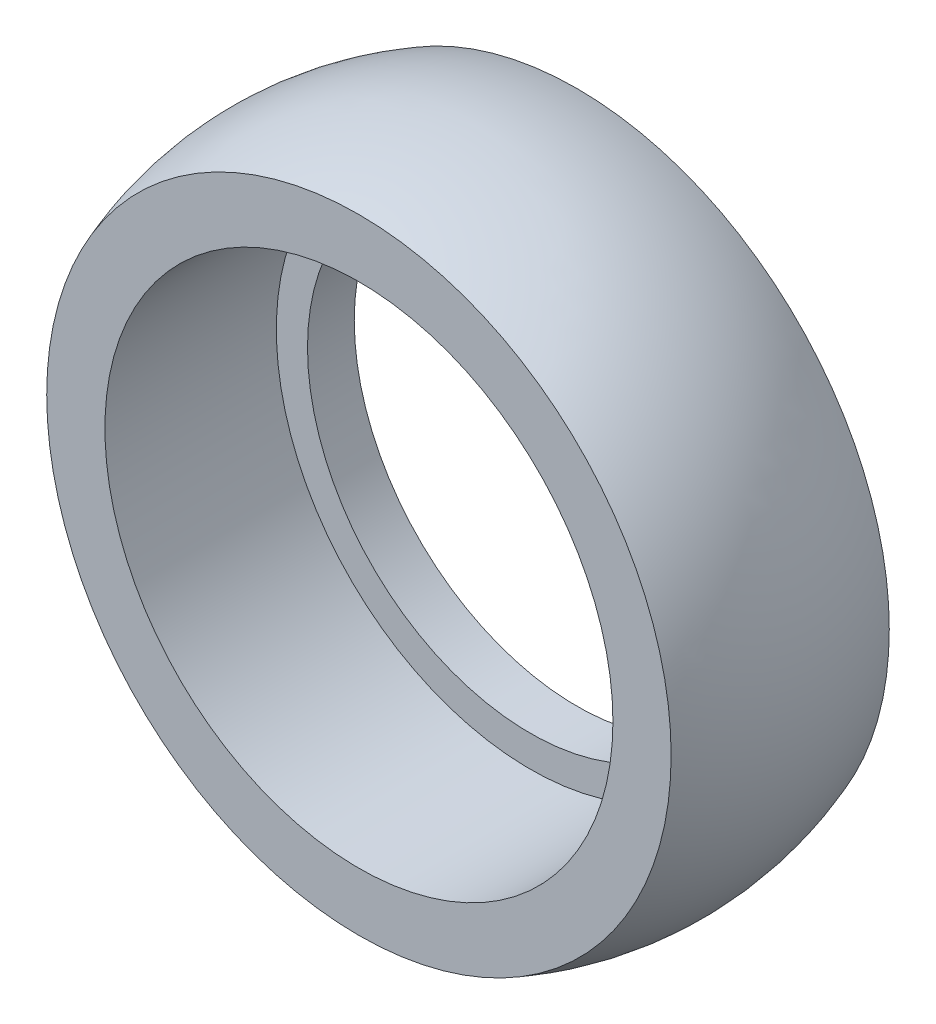
ISO-10303-21;
HEADER;
FILE_DESCRIPTION(('STEP AP214'),'2;1');
FILE_NAME('part.step','',(''),(''),'','','');
FILE_SCHEMA(('AUTOMOTIVE_DESIGN { 1 0 10303 214 1 1 1 1 }'));
ENDSEC;
DATA;
#1=APPLICATION_CONTEXT('core data for automotive mechanical design processes');
#2=APPLICATION_PROTOCOL_DEFINITION('international standard','automotive_design',2000,#1);
#3=PRODUCT_CONTEXT('',#1,'mechanical');
#4=PRODUCT('Part','Part','',(#3));
#5=PRODUCT_RELATED_PRODUCT_CATEGORY('part','',(#4));
#6=PRODUCT_DEFINITION_FORMATION('','',#4);
#7=PRODUCT_DEFINITION_CONTEXT('part definition',#1,'design');
#8=PRODUCT_DEFINITION('design','',#6,#7);
#9=PRODUCT_DEFINITION_SHAPE('','',#8);
#10=(LENGTH_UNIT() NAMED_UNIT(*) SI_UNIT(.MILLI.,.METRE.));
#11=(NAMED_UNIT(*) PLANE_ANGLE_UNIT() SI_UNIT($,.RADIAN.));
#12=(NAMED_UNIT(*) SI_UNIT($,.STERADIAN.) SOLID_ANGLE_UNIT());
#13=UNCERTAINTY_MEASURE_WITH_UNIT(LENGTH_MEASURE(1.E-05),#10,'distance_accuracy_value','');
#14=(GEOMETRIC_REPRESENTATION_CONTEXT(3) GLOBAL_UNCERTAINTY_ASSIGNED_CONTEXT((#13)) GLOBAL_UNIT_ASSIGNED_CONTEXT((#10,
#11,#12)) REPRESENTATION_CONTEXT('',''));
#15=CARTESIAN_POINT('',(0.,0.,0.));
#16=DIRECTION('',(0.,0.,1.));
#17=DIRECTION('',(1.,0.,0.));
#18=AXIS2_PLACEMENT_3D('',#15,#16,#17);
#19=CARTESIAN_POINT('',(0.,0.,3.5));
#20=DIRECTION('',(0.,0.,1.));
#21=DIRECTION('',(1.,0.,0.));
#22=AXIS2_PLACEMENT_3D('',#19,#20,#21);
#23=DEGENERATE_TOROIDAL_SURFACE('',#22,0.650000000000001,10.,.T.);
#24=CARTESIAN_POINT('',(0.,0.,7.));
#25=DIRECTION('',(0.,0.,1.));
#26=DIRECTION('',(1.,0.,0.));
#27=AXIS2_PLACEMENT_3D('',#24,#25,#26);
#28=CIRCLE('',#27,10.0174969975976);
#29=CARTESIAN_POINT('',(10.0174969975976,0.,7.));
#30=VERTEX_POINT('',#29);
#31=EDGE_CURVE('E10',#30,#30,#28,.T.);
#32=ORIENTED_EDGE('',*,*,#31,.F.);
#33=EDGE_LOOP('',(#32));
#34=FACE_BOUND('',#33,.T.);
#35=CARTESIAN_POINT('',(0.,0.,0.));
#36=DIRECTION('',(0.,0.,1.));
#37=DIRECTION('',(1.,0.,0.));
#38=AXIS2_PLACEMENT_3D('',#35,#36,#37);
#39=CIRCLE('',#38,10.0174969975976);
#40=CARTESIAN_POINT('',(10.0174969975976,0.,0.));
#41=VERTEX_POINT('',#40);
#42=EDGE_CURVE('E52',#41,#41,#39,.T.);
#43=ORIENTED_EDGE('',*,*,#42,.T.);
#44=EDGE_LOOP('',(#43));
#45=FACE_BOUND('',#44,.T.);
#46=ADVANCED_FACE('F30',(#34,#45),#23,.T.);
#47=CARTESIAN_POINT('',(0.,10.0174969975976,7.));
#48=DIRECTION('',(0.,0.,-1.));
#49=DIRECTION('',(-1.,0.,0.));
#50=AXIS2_PLACEMENT_3D('',#47,#48,#49);
#51=PLANE('',#50);
#52=CARTESIAN_POINT('',(0.,0.,7.));
#53=DIRECTION('',(0.,0.,1.));
#54=DIRECTION('',(1.,0.,0.));
#55=AXIS2_PLACEMENT_3D('',#52,#53,#54);
#56=CIRCLE('',#55,8.15);
#57=CARTESIAN_POINT('',(8.15,0.,7.));
#58=VERTEX_POINT('',#57);
#59=EDGE_CURVE('E36',#58,#58,#56,.T.);
#60=ORIENTED_EDGE('',*,*,#59,.F.);
#61=EDGE_LOOP('',(#60));
#62=FACE_BOUND('',#61,.T.);
#63=ORIENTED_EDGE('',*,*,#31,.T.);
#64=EDGE_LOOP('',(#63));
#65=FACE_BOUND('',#64,.T.);
#66=ADVANCED_FACE('F77',(#62,#65),#51,.F.);
#67=CARTESIAN_POINT('',(0.,0.,0.));
#68=DIRECTION('',(0.,0.,1.));
#69=DIRECTION('',(1.,0.,0.));
#70=AXIS2_PLACEMENT_3D('',#67,#68,#69);
#71=CYLINDRICAL_SURFACE('',#70,8.15);
#72=CARTESIAN_POINT('',(0.,0.,1.5));
#73=DIRECTION('',(0.,0.,1.));
#74=DIRECTION('',(1.,0.,0.));
#75=AXIS2_PLACEMENT_3D('',#72,#73,#74);
#76=CIRCLE('',#75,8.15);
#77=CARTESIAN_POINT('',(8.15,0.,1.5));
#78=VERTEX_POINT('',#77);
#79=EDGE_CURVE('E40',#78,#78,#76,.T.);
#80=ORIENTED_EDGE('',*,*,#79,.F.);
#81=EDGE_LOOP('',(#80));
#82=FACE_BOUND('',#81,.T.);
#83=ORIENTED_EDGE('',*,*,#59,.T.);
#84=EDGE_LOOP('',(#83));
#85=FACE_BOUND('',#84,.T.);
#86=ADVANCED_FACE('F72',(#82,#85),#71,.F.);
#87=CARTESIAN_POINT('',(0.,7.15,1.5));
#88=DIRECTION('',(0.,0.,-1.));
#89=DIRECTION('',(-1.,0.,0.));
#90=AXIS2_PLACEMENT_3D('',#87,#88,#89);
#91=PLANE('',#90);
#92=CARTESIAN_POINT('',(0.,0.,1.5));
#93=DIRECTION('',(0.,0.,1.));
#94=DIRECTION('',(1.,0.,0.));
#95=AXIS2_PLACEMENT_3D('',#92,#93,#94);
#96=CIRCLE('',#95,7.15);
#97=CARTESIAN_POINT('',(7.15,0.,1.5));
#98=VERTEX_POINT('',#97);
#99=EDGE_CURVE('E44',#98,#98,#96,.T.);
#100=ORIENTED_EDGE('',*,*,#99,.F.);
#101=EDGE_LOOP('',(#100));
#102=FACE_BOUND('',#101,.T.);
#103=ORIENTED_EDGE('',*,*,#79,.T.);
#104=EDGE_LOOP('',(#103));
#105=FACE_BOUND('',#104,.T.);
#106=ADVANCED_FACE('F66',(#102,#105),#91,.F.);
#107=CARTESIAN_POINT('',(0.,0.,0.));
#108=DIRECTION('',(0.,0.,1.));
#109=DIRECTION('',(1.,0.,0.));
#110=AXIS2_PLACEMENT_3D('',#107,#108,#109);
#111=CYLINDRICAL_SURFACE('',#110,7.15);
#112=CARTESIAN_POINT('',(0.,0.,0.));
#113=DIRECTION('',(0.,0.,1.));
#114=DIRECTION('',(1.,0.,0.));
#115=AXIS2_PLACEMENT_3D('',#112,#113,#114);
#116=CIRCLE('',#115,7.15);
#117=CARTESIAN_POINT('',(7.15,0.,0.));
#118=VERTEX_POINT('',#117);
#119=EDGE_CURVE('E49',#118,#118,#116,.T.);
#120=ORIENTED_EDGE('',*,*,#119,.F.);
#121=EDGE_LOOP('',(#120));
#122=FACE_BOUND('',#121,.T.);
#123=ORIENTED_EDGE('',*,*,#99,.T.);
#124=EDGE_LOOP('',(#123));
#125=FACE_BOUND('',#124,.T.);
#126=ADVANCED_FACE('F60',(#122,#125),#111,.F.);
#127=CARTESIAN_POINT('',(0.,10.0174969975976,0.));
#128=DIRECTION('',(0.,0.,1.));
#129=DIRECTION('',(1.,0.,0.));
#130=AXIS2_PLACEMENT_3D('',#127,#128,#129);
#131=PLANE('',#130);
#132=ORIENTED_EDGE('',*,*,#42,.F.);
#133=EDGE_LOOP('',(#132));
#134=FACE_BOUND('',#133,.T.);
#135=ORIENTED_EDGE('',*,*,#119,.T.);
#136=EDGE_LOOP('',(#135));
#137=FACE_BOUND('',#136,.T.);
#138=ADVANCED_FACE('F57',(#134,#137),#131,.F.);
#139=CLOSED_SHELL('',(#46,#66,#86,#106,#126,#138));
#140=MANIFOLD_SOLID_BREP('B2',#139);
#141=ADVANCED_BREP_SHAPE_REPRESENTATION('',(#18,#140),#14);
#142=SHAPE_DEFINITION_REPRESENTATION(#9,#141);
ENDSEC;
END-ISO-10303-21;
